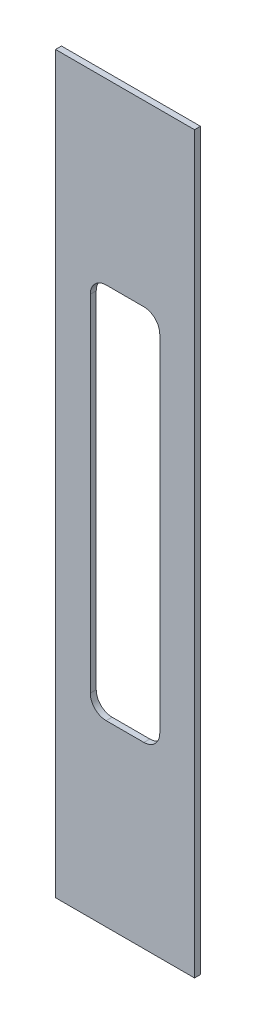
ISO-10303-21;
HEADER;
FILE_DESCRIPTION(('STEP AP214'),'2;1');
FILE_NAME('part.step','',(''),(''),'','','');
FILE_SCHEMA(('AUTOMOTIVE_DESIGN { 1 0 10303 214 1 1 1 1 }'));
ENDSEC;
DATA;
#1=APPLICATION_CONTEXT('core data for automotive mechanical design processes');
#2=APPLICATION_PROTOCOL_DEFINITION('international standard','automotive_design',2000,#1);
#3=PRODUCT_CONTEXT('',#1,'mechanical');
#4=PRODUCT('Part','Part','',(#3));
#5=PRODUCT_RELATED_PRODUCT_CATEGORY('part','',(#4));
#6=PRODUCT_DEFINITION_FORMATION('','',#4);
#7=PRODUCT_DEFINITION_CONTEXT('part definition',#1,'design');
#8=PRODUCT_DEFINITION('design','',#6,#7);
#9=PRODUCT_DEFINITION_SHAPE('','',#8);
#10=(LENGTH_UNIT() NAMED_UNIT(*) SI_UNIT(.MILLI.,.METRE.));
#11=(NAMED_UNIT(*) PLANE_ANGLE_UNIT() SI_UNIT($,.RADIAN.));
#12=(NAMED_UNIT(*) SI_UNIT($,.STERADIAN.) SOLID_ANGLE_UNIT());
#13=UNCERTAINTY_MEASURE_WITH_UNIT(LENGTH_MEASURE(1.E-05),#10,'distance_accuracy_value','');
#14=(GEOMETRIC_REPRESENTATION_CONTEXT(3) GLOBAL_UNCERTAINTY_ASSIGNED_CONTEXT((#13)) GLOBAL_UNIT_ASSIGNED_CONTEXT((#10,
#11,#12)) REPRESENTATION_CONTEXT('',''));
#15=CARTESIAN_POINT('',(0.,0.,0.));
#16=DIRECTION('',(0.,0.,1.));
#17=DIRECTION('',(1.,0.,0.));
#18=AXIS2_PLACEMENT_3D('',#15,#16,#17);
#19=CARTESIAN_POINT('',(-130.,185.,114.499999999999));
#20=DIRECTION('',(0.,1.,0.));
#21=DIRECTION('',(0.,0.,1.));
#22=AXIS2_PLACEMENT_3D('',#19,#20,#21);
#23=PLANE('',#22);
#24=DIRECTION('',(1.,0.,0.));
#25=VECTOR('',#24,1.);
#26=CARTESIAN_POINT('',(-130.,185.,111.499999999999));
#27=LINE('',#26,#25);
#28=CARTESIAN_POINT('',(-130.,185.,111.499999999999));
#29=VERTEX_POINT('',#28);
#30=CARTESIAN_POINT('',(-60.0000000000003,185.,111.499999999999));
#31=VERTEX_POINT('',#30);
#32=EDGE_CURVE('E131',#29,#31,#27,.T.);
#33=ORIENTED_EDGE('',*,*,#32,.F.);
#34=DIRECTION('',(0.,0.,-1.));
#35=VECTOR('',#34,1.);
#36=CARTESIAN_POINT('',(-130.,185.,114.499999999999));
#37=LINE('',#36,#35);
#38=CARTESIAN_POINT('',(-130.,185.,114.499999999999));
#39=VERTEX_POINT('',#38);
#40=EDGE_CURVE('E11',#39,#29,#37,.T.);
#41=ORIENTED_EDGE('',*,*,#40,.F.);
#42=DIRECTION('',(1.,0.,0.));
#43=VECTOR('',#42,1.);
#44=CARTESIAN_POINT('',(-130.,185.,114.499999999999));
#45=LINE('',#44,#43);
#46=CARTESIAN_POINT('',(-60.0000000000003,185.,114.499999999999));
#47=VERTEX_POINT('',#46);
#48=EDGE_CURVE('E181',#39,#47,#45,.T.);
#49=ORIENTED_EDGE('',*,*,#48,.T.);
#50=DIRECTION('',(0.,0.,-1.));
#51=VECTOR('',#50,1.);
#52=CARTESIAN_POINT('',(-60.0000000000003,185.,114.499999999999));
#53=LINE('',#52,#51);
#54=EDGE_CURVE('E39',#47,#31,#53,.T.);
#55=ORIENTED_EDGE('',*,*,#54,.T.);
#56=EDGE_LOOP('',(#33,#41,#49,#55));
#57=FACE_BOUND('',#56,.T.);
#58=ADVANCED_FACE('F36',(#57),#23,.T.);
#59=CARTESIAN_POINT('',(-130.,185.,114.499999999999));
#60=DIRECTION('',(-1.,0.,0.));
#61=DIRECTION('',(0.,0.,1.));
#62=AXIS2_PLACEMENT_3D('',#59,#60,#61);
#63=PLANE('',#62);
#64=DIRECTION('',(0.,1.,0.));
#65=VECTOR('',#64,1.);
#66=CARTESIAN_POINT('',(-130.,185.,111.499999999999));
#67=LINE('',#66,#65);
#68=CARTESIAN_POINT('',(-130.,-185.,111.499999999999));
#69=VERTEX_POINT('',#68);
#70=EDGE_CURVE('E185',#69,#29,#67,.T.);
#71=ORIENTED_EDGE('',*,*,#70,.F.);
#72=DIRECTION('',(0.,0.,-1.));
#73=VECTOR('',#72,1.);
#74=CARTESIAN_POINT('',(-130.,-185.,114.499999999999));
#75=LINE('',#74,#73);
#76=CARTESIAN_POINT('',(-130.,-185.,114.499999999999));
#77=VERTEX_POINT('',#76);
#78=EDGE_CURVE('E44',#77,#69,#75,.T.);
#79=ORIENTED_EDGE('',*,*,#78,.F.);
#80=DIRECTION('',(0.,1.,0.));
#81=VECTOR('',#80,1.);
#82=CARTESIAN_POINT('',(-130.,185.,114.499999999999));
#83=LINE('',#82,#81);
#84=EDGE_CURVE('E191',#77,#39,#83,.T.);
#85=ORIENTED_EDGE('',*,*,#84,.T.);
#86=ORIENTED_EDGE('',*,*,#40,.T.);
#87=EDGE_LOOP('',(#71,#79,#85,#86));
#88=FACE_BOUND('',#87,.T.);
#89=ADVANCED_FACE('F215',(#88),#63,.T.);
#90=CARTESIAN_POINT('',(-130.,-185.,114.499999999999));
#91=DIRECTION('',(0.,-1.,0.));
#92=DIRECTION('',(0.,0.,-1.));
#93=AXIS2_PLACEMENT_3D('',#90,#91,#92);
#94=PLANE('',#93);
#95=DIRECTION('',(-1.,0.,0.));
#96=VECTOR('',#95,1.);
#97=CARTESIAN_POINT('',(-130.,-185.,111.499999999999));
#98=LINE('',#97,#96);
#99=CARTESIAN_POINT('',(-60.0000000000003,-185.,111.499999999999));
#100=VERTEX_POINT('',#99);
#101=EDGE_CURVE('E199',#100,#69,#98,.T.);
#102=ORIENTED_EDGE('',*,*,#101,.F.);
#103=DIRECTION('',(0.,0.,-1.));
#104=VECTOR('',#103,1.);
#105=CARTESIAN_POINT('',(-60.0000000000003,-185.,114.499999999999));
#106=LINE('',#105,#104);
#107=CARTESIAN_POINT('',(-60.0000000000003,-185.,114.499999999999));
#108=VERTEX_POINT('',#107);
#109=EDGE_CURVE('E204',#108,#100,#106,.T.);
#110=ORIENTED_EDGE('',*,*,#109,.F.);
#111=DIRECTION('',(-1.,0.,0.));
#112=VECTOR('',#111,1.);
#113=CARTESIAN_POINT('',(-130.,-185.,114.499999999999));
#114=LINE('',#113,#112);
#115=EDGE_CURVE('E188',#108,#77,#114,.T.);
#116=ORIENTED_EDGE('',*,*,#115,.T.);
#117=ORIENTED_EDGE('',*,*,#78,.T.);
#118=EDGE_LOOP('',(#102,#110,#116,#117));
#119=FACE_BOUND('',#118,.T.);
#120=ADVANCED_FACE('F221',(#119),#94,.T.);
#121=CARTESIAN_POINT('',(-60.0000000000003,185.,114.499999999999));
#122=DIRECTION('',(1.,0.,0.));
#123=DIRECTION('',(0.,0.,-1.));
#124=AXIS2_PLACEMENT_3D('',#121,#122,#123);
#125=PLANE('',#124);
#126=DIRECTION('',(0.,-1.,0.));
#127=VECTOR('',#126,1.);
#128=CARTESIAN_POINT('',(-60.0000000000003,185.,111.499999999999));
#129=LINE('',#128,#127);
#130=EDGE_CURVE('E196',#31,#100,#129,.T.);
#131=ORIENTED_EDGE('',*,*,#130,.F.);
#132=ORIENTED_EDGE('',*,*,#54,.F.);
#133=DIRECTION('',(0.,-1.,0.));
#134=VECTOR('',#133,1.);
#135=CARTESIAN_POINT('',(-60.0000000000003,185.,114.499999999999));
#136=LINE('',#135,#134);
#137=EDGE_CURVE('E184',#47,#108,#136,.T.);
#138=ORIENTED_EDGE('',*,*,#137,.T.);
#139=ORIENTED_EDGE('',*,*,#109,.T.);
#140=EDGE_LOOP('',(#131,#132,#138,#139));
#141=FACE_BOUND('',#140,.T.);
#142=ADVANCED_FACE('F212',(#141),#125,.T.);
#143=CARTESIAN_POINT('',(-3.1780134079895E-13,0.,114.499999999999));
#144=DIRECTION('',(0.,0.,-1.));
#145=DIRECTION('',(-1.,0.,0.));
#146=AXIS2_PLACEMENT_3D('',#143,#144,#145);
#147=PLANE('',#146);
#148=DIRECTION('',(0.,-1.,0.));
#149=VECTOR('',#148,1.);
#150=CARTESIAN_POINT('',(-112.5,-87.,114.499999999999));
#151=LINE('',#150,#149);
#152=CARTESIAN_POINT('',(-112.5,86.9999999999999,114.499999999999));
#153=VERTEX_POINT('',#152);
#154=CARTESIAN_POINT('',(-112.5,-87.,114.499999999999));
#155=VERTEX_POINT('',#154);
#156=EDGE_CURVE('E145',#153,#155,#151,.T.);
#157=ORIENTED_EDGE('',*,*,#156,.F.);
#158=CARTESIAN_POINT('',(-104.5,87.,114.499999999999));
#159=DIRECTION('',(0.,0.,1.));
#160=DIRECTION('',(1.,0.,0.));
#161=AXIS2_PLACEMENT_3D('',#158,#159,#160);
#162=CIRCLE('',#161,7.99999999999999);
#163=CARTESIAN_POINT('',(-104.5,95.,114.499999999999));
#164=VERTEX_POINT('',#163);
#165=EDGE_CURVE('E52',#164,#153,#162,.T.);
#166=ORIENTED_EDGE('',*,*,#165,.F.);
#167=DIRECTION('',(-1.,0.,0.));
#168=VECTOR('',#167,1.);
#169=CARTESIAN_POINT('',(-85.5000000000003,95.,114.499999999999));
#170=LINE('',#169,#168);
#171=CARTESIAN_POINT('',(-85.5000000000003,95.,114.499999999999));
#172=VERTEX_POINT('',#171);
#173=EDGE_CURVE('E137',#172,#164,#170,.T.);
#174=ORIENTED_EDGE('',*,*,#173,.F.);
#175=CARTESIAN_POINT('',(-85.5000000000003,87.,114.499999999999));
#176=DIRECTION('',(0.,0.,1.));
#177=DIRECTION('',(1.,0.,0.));
#178=AXIS2_PLACEMENT_3D('',#175,#176,#177);
#179=CIRCLE('',#178,8.);
#180=CARTESIAN_POINT('',(-77.5000000000003,86.9999999999999,114.499999999999));
#181=VERTEX_POINT('',#180);
#182=EDGE_CURVE('E164',#181,#172,#179,.T.);
#183=ORIENTED_EDGE('',*,*,#182,.F.);
#184=DIRECTION('',(0.,1.,0.));
#185=VECTOR('',#184,1.);
#186=CARTESIAN_POINT('',(-77.5000000000003,-87.,114.499999999999));
#187=LINE('',#186,#185);
#188=CARTESIAN_POINT('',(-77.5000000000003,-87.,114.499999999999));
#189=VERTEX_POINT('',#188);
#190=EDGE_CURVE('E161',#189,#181,#187,.T.);
#191=ORIENTED_EDGE('',*,*,#190,.F.);
#192=CARTESIAN_POINT('',(-85.5000000000003,-87.,114.499999999999));
#193=DIRECTION('',(0.,0.,1.));
#194=DIRECTION('',(1.,0.,0.));
#195=AXIS2_PLACEMENT_3D('',#192,#193,#194);
#196=CIRCLE('',#195,8.00000000000001);
#197=CARTESIAN_POINT('',(-85.5000000000003,-95.,114.499999999999));
#198=VERTEX_POINT('',#197);
#199=EDGE_CURVE('E158',#198,#189,#196,.T.);
#200=ORIENTED_EDGE('',*,*,#199,.F.);
#201=DIRECTION('',(1.,0.,0.));
#202=VECTOR('',#201,1.);
#203=CARTESIAN_POINT('',(-85.5000000000003,-95.,114.499999999999));
#204=LINE('',#203,#202);
#205=CARTESIAN_POINT('',(-104.5,-95.,114.499999999999));
#206=VERTEX_POINT('',#205);
#207=EDGE_CURVE('E155',#206,#198,#204,.T.);
#208=ORIENTED_EDGE('',*,*,#207,.F.);
#209=CARTESIAN_POINT('',(-104.5,-87.,114.499999999999));
#210=DIRECTION('',(0.,0.,1.));
#211=DIRECTION('',(-1.,0.,0.));
#212=AXIS2_PLACEMENT_3D('',#209,#210,#211);
#213=CIRCLE('',#212,8.);
#214=EDGE_CURVE('E152',#155,#206,#213,.T.);
#215=ORIENTED_EDGE('',*,*,#214,.F.);
#216=EDGE_LOOP('',(#157,#166,#174,#183,#191,#200,#208,#215));
#217=FACE_BOUND('',#216,.T.);
#218=ORIENTED_EDGE('',*,*,#48,.F.);
#219=ORIENTED_EDGE('',*,*,#84,.F.);
#220=ORIENTED_EDGE('',*,*,#115,.F.);
#221=ORIENTED_EDGE('',*,*,#137,.F.);
#222=EDGE_LOOP('',(#218,#219,#220,#221));
#223=FACE_BOUND('',#222,.T.);
#224=ADVANCED_FACE('F218',(#217,#223),#147,.F.);
#225=CARTESIAN_POINT('',(-3.09474668114261E-13,0.,111.499999999999));
#226=DIRECTION('',(0.,0.,-1.));
#227=DIRECTION('',(-1.,0.,0.));
#228=AXIS2_PLACEMENT_3D('',#225,#226,#227);
#229=PLANE('',#228);
#230=CARTESIAN_POINT('',(-104.5,87.,111.499999999999));
#231=DIRECTION('',(0.,0.,-1.));
#232=DIRECTION('',(-1.,0.,0.));
#233=AXIS2_PLACEMENT_3D('',#230,#231,#232);
#234=CIRCLE('',#233,7.99999999999999);
#235=CARTESIAN_POINT('',(-104.5,95.,111.499999999999));
#236=VERTEX_POINT('',#235);
#237=CARTESIAN_POINT('',(-112.5,86.9999999999999,111.499999999999));
#238=VERTEX_POINT('',#237);
#239=EDGE_CURVE('E135',#236,#238,#234,.F.);
#240=ORIENTED_EDGE('',*,*,#239,.T.);
#241=DIRECTION('',(0.,-1.,0.));
#242=VECTOR('',#241,1.);
#243=CARTESIAN_POINT('',(-112.5,-87.,111.499999999999));
#244=LINE('',#243,#242);
#245=CARTESIAN_POINT('',(-112.5,-87.,111.499999999999));
#246=VERTEX_POINT('',#245);
#247=EDGE_CURVE('E124',#238,#246,#244,.T.);
#248=ORIENTED_EDGE('',*,*,#247,.T.);
#249=CARTESIAN_POINT('',(-104.5,-87.,111.499999999999));
#250=DIRECTION('',(0.,0.,-1.));
#251=DIRECTION('',(-1.,0.,0.));
#252=AXIS2_PLACEMENT_3D('',#249,#250,#251);
#253=CIRCLE('',#252,8.);
#254=CARTESIAN_POINT('',(-104.5,-95.,111.499999999999));
#255=VERTEX_POINT('',#254);
#256=EDGE_CURVE('E346',#246,#255,#253,.F.);
#257=ORIENTED_EDGE('',*,*,#256,.T.);
#258=DIRECTION('',(1.,0.,0.));
#259=VECTOR('',#258,1.);
#260=CARTESIAN_POINT('',(-85.5000000000003,-95.,111.499999999999));
#261=LINE('',#260,#259);
#262=CARTESIAN_POINT('',(-85.5000000000003,-95.,111.499999999999));
#263=VERTEX_POINT('',#262);
#264=EDGE_CURVE('E351',#255,#263,#261,.T.);
#265=ORIENTED_EDGE('',*,*,#264,.T.);
#266=CARTESIAN_POINT('',(-85.5000000000003,-87.,111.499999999999));
#267=DIRECTION('',(0.,0.,-1.));
#268=DIRECTION('',(-1.,0.,0.));
#269=AXIS2_PLACEMENT_3D('',#266,#267,#268);
#270=CIRCLE('',#269,8.00000000000001);
#271=CARTESIAN_POINT('',(-77.5000000000003,-87.,111.499999999999));
#272=VERTEX_POINT('',#271);
#273=EDGE_CURVE('E354',#263,#272,#270,.F.);
#274=ORIENTED_EDGE('',*,*,#273,.T.);
#275=DIRECTION('',(0.,1.,0.));
#276=VECTOR('',#275,1.);
#277=CARTESIAN_POINT('',(-77.5000000000003,-87.,111.499999999999));
#278=LINE('',#277,#276);
#279=CARTESIAN_POINT('',(-77.5000000000003,86.9999999999999,111.499999999999));
#280=VERTEX_POINT('',#279);
#281=EDGE_CURVE('E358',#272,#280,#278,.T.);
#282=ORIENTED_EDGE('',*,*,#281,.T.);
#283=CARTESIAN_POINT('',(-85.5000000000003,87.,111.499999999999));
#284=DIRECTION('',(0.,0.,-1.));
#285=DIRECTION('',(-1.,0.,0.));
#286=AXIS2_PLACEMENT_3D('',#283,#284,#285);
#287=CIRCLE('',#286,8.);
#288=CARTESIAN_POINT('',(-85.5000000000003,95.,111.499999999999));
#289=VERTEX_POINT('',#288);
#290=EDGE_CURVE('E147',#280,#289,#287,.F.);
#291=ORIENTED_EDGE('',*,*,#290,.T.);
#292=DIRECTION('',(-1.,0.,0.));
#293=VECTOR('',#292,1.);
#294=CARTESIAN_POINT('',(-85.5000000000003,95.,111.499999999999));
#295=LINE('',#294,#293);
#296=EDGE_CURVE('E143',#289,#236,#295,.T.);
#297=ORIENTED_EDGE('',*,*,#296,.T.);
#298=EDGE_LOOP('',(#240,#248,#257,#265,#274,#282,#291,#297));
#299=FACE_BOUND('',#298,.T.);
#300=ORIENTED_EDGE('',*,*,#32,.T.);
#301=ORIENTED_EDGE('',*,*,#130,.T.);
#302=ORIENTED_EDGE('',*,*,#101,.T.);
#303=ORIENTED_EDGE('',*,*,#70,.T.);
#304=EDGE_LOOP('',(#300,#301,#302,#303));
#305=FACE_BOUND('',#304,.T.);
#306=ADVANCED_FACE('F140',(#299,#305),#229,.T.);
#307=CARTESIAN_POINT('',(-104.5,87.,111.498999999999));
#308=DIRECTION('',(0.,0.,1.));
#309=DIRECTION('',(1.,0.,0.));
#310=AXIS2_PLACEMENT_3D('',#307,#308,#309);
#311=CYLINDRICAL_SURFACE('',#310,7.99999999999999);
#312=DIRECTION('',(0.,0.,1.));
#313=VECTOR('',#312,1.);
#314=CARTESIAN_POINT('',(-104.5,95.,111.498999999999));
#315=LINE('',#314,#313);
#316=EDGE_CURVE('E132',#236,#164,#315,.T.);
#317=ORIENTED_EDGE('',*,*,#316,.T.);
#318=ORIENTED_EDGE('',*,*,#165,.T.);
#319=DIRECTION('',(0.,0.,1.));
#320=VECTOR('',#319,1.);
#321=CARTESIAN_POINT('',(-112.5,86.9999999999999,111.498999999999));
#322=LINE('',#321,#320);
#323=EDGE_CURVE('E126',#238,#153,#322,.T.);
#324=ORIENTED_EDGE('',*,*,#323,.F.);
#325=ORIENTED_EDGE('',*,*,#239,.F.);
#326=EDGE_LOOP('',(#317,#318,#324,#325));
#327=FACE_BOUND('',#326,.T.);
#328=ADVANCED_FACE('F134',(#327),#311,.F.);
#329=CARTESIAN_POINT('',(-85.5000000000003,95.,111.498999999999));
#330=DIRECTION('',(0.,1.,0.));
#331=DIRECTION('',(0.,0.,1.));
#332=AXIS2_PLACEMENT_3D('',#329,#330,#331);
#333=PLANE('',#332);
#334=DIRECTION('',(0.,0.,1.));
#335=VECTOR('',#334,1.);
#336=CARTESIAN_POINT('',(-85.5000000000003,95.,111.498999999999));
#337=LINE('',#336,#335);
#338=EDGE_CURVE('E170',#289,#172,#337,.T.);
#339=ORIENTED_EDGE('',*,*,#338,.T.);
#340=ORIENTED_EDGE('',*,*,#173,.T.);
#341=ORIENTED_EDGE('',*,*,#316,.F.);
#342=ORIENTED_EDGE('',*,*,#296,.F.);
#343=EDGE_LOOP('',(#339,#340,#341,#342));
#344=FACE_BOUND('',#343,.T.);
#345=ADVANCED_FACE('F272',(#344),#333,.F.);
#346=CARTESIAN_POINT('',(-85.5000000000003,87.,111.498999999999));
#347=DIRECTION('',(0.,0.,1.));
#348=DIRECTION('',(1.,0.,0.));
#349=AXIS2_PLACEMENT_3D('',#346,#347,#348);
#350=CYLINDRICAL_SURFACE('',#349,8.);
#351=DIRECTION('',(0.,0.,1.));
#352=VECTOR('',#351,1.);
#353=CARTESIAN_POINT('',(-77.5000000000003,86.9999999999999,111.498999999999));
#354=LINE('',#353,#352);
#355=EDGE_CURVE('E172',#280,#181,#354,.T.);
#356=ORIENTED_EDGE('',*,*,#355,.T.);
#357=ORIENTED_EDGE('',*,*,#182,.T.);
#358=ORIENTED_EDGE('',*,*,#338,.F.);
#359=ORIENTED_EDGE('',*,*,#290,.F.);
#360=EDGE_LOOP('',(#356,#357,#358,#359));
#361=FACE_BOUND('',#360,.T.);
#362=ADVANCED_FACE('F281',(#361),#350,.F.);
#363=CARTESIAN_POINT('',(-77.5000000000003,-87.,111.498999999999));
#364=DIRECTION('',(1.,0.,0.));
#365=DIRECTION('',(0.,0.,-1.));
#366=AXIS2_PLACEMENT_3D('',#363,#364,#365);
#367=PLANE('',#366);
#368=DIRECTION('',(0.,0.,1.));
#369=VECTOR('',#368,1.);
#370=CARTESIAN_POINT('',(-77.5000000000003,-87.,111.498999999999));
#371=LINE('',#370,#369);
#372=EDGE_CURVE('E174',#272,#189,#371,.T.);
#373=ORIENTED_EDGE('',*,*,#372,.T.);
#374=ORIENTED_EDGE('',*,*,#190,.T.);
#375=ORIENTED_EDGE('',*,*,#355,.F.);
#376=ORIENTED_EDGE('',*,*,#281,.F.);
#377=EDGE_LOOP('',(#373,#374,#375,#376));
#378=FACE_BOUND('',#377,.T.);
#379=ADVANCED_FACE('F291',(#378),#367,.F.);
#380=CARTESIAN_POINT('',(-85.5000000000003,-87.,111.498999999999));
#381=DIRECTION('',(0.,0.,1.));
#382=DIRECTION('',(1.,0.,0.));
#383=AXIS2_PLACEMENT_3D('',#380,#381,#382);
#384=CYLINDRICAL_SURFACE('',#383,8.00000000000001);
#385=DIRECTION('',(0.,0.,1.));
#386=VECTOR('',#385,1.);
#387=CARTESIAN_POINT('',(-85.5000000000003,-95.,111.498999999999));
#388=LINE('',#387,#386);
#389=EDGE_CURVE('E176',#263,#198,#388,.T.);
#390=ORIENTED_EDGE('',*,*,#389,.T.);
#391=ORIENTED_EDGE('',*,*,#199,.T.);
#392=ORIENTED_EDGE('',*,*,#372,.F.);
#393=ORIENTED_EDGE('',*,*,#273,.F.);
#394=EDGE_LOOP('',(#390,#391,#392,#393));
#395=FACE_BOUND('',#394,.T.);
#396=ADVANCED_FACE('F301',(#395),#384,.F.);
#397=CARTESIAN_POINT('',(-85.5000000000003,-95.,111.498999999999));
#398=DIRECTION('',(0.,-1.,0.));
#399=DIRECTION('',(1.,0.,0.));
#400=AXIS2_PLACEMENT_3D('',#397,#398,#399);
#401=PLANE('',#400);
#402=DIRECTION('',(0.,0.,1.));
#403=VECTOR('',#402,1.);
#404=CARTESIAN_POINT('',(-104.5,-95.,111.498999999999));
#405=LINE('',#404,#403);
#406=EDGE_CURVE('E178',#255,#206,#405,.T.);
#407=ORIENTED_EDGE('',*,*,#406,.T.);
#408=ORIENTED_EDGE('',*,*,#207,.T.);
#409=ORIENTED_EDGE('',*,*,#389,.F.);
#410=ORIENTED_EDGE('',*,*,#264,.F.);
#411=EDGE_LOOP('',(#407,#408,#409,#410));
#412=FACE_BOUND('',#411,.T.);
#413=ADVANCED_FACE('F311',(#412),#401,.F.);
#414=CARTESIAN_POINT('',(-104.5,-87.,111.498999999999));
#415=DIRECTION('',(0.,0.,1.));
#416=DIRECTION('',(1.,0.,0.));
#417=AXIS2_PLACEMENT_3D('',#414,#415,#416);
#418=CYLINDRICAL_SURFACE('',#417,8.);
#419=DIRECTION('',(0.,0.,1.));
#420=VECTOR('',#419,1.);
#421=CARTESIAN_POINT('',(-112.5,-87.,111.498999999999));
#422=LINE('',#421,#420);
#423=EDGE_CURVE('E60',#246,#155,#422,.T.);
#424=ORIENTED_EDGE('',*,*,#423,.T.);
#425=ORIENTED_EDGE('',*,*,#214,.T.);
#426=ORIENTED_EDGE('',*,*,#406,.F.);
#427=ORIENTED_EDGE('',*,*,#256,.F.);
#428=EDGE_LOOP('',(#424,#425,#426,#427));
#429=FACE_BOUND('',#428,.T.);
#430=ADVANCED_FACE('F321',(#429),#418,.F.);
#431=CARTESIAN_POINT('',(-112.5,-87.,111.498999999999));
#432=DIRECTION('',(-1.,0.,0.));
#433=DIRECTION('',(0.,0.,1.));
#434=AXIS2_PLACEMENT_3D('',#431,#432,#433);
#435=PLANE('',#434);
#436=ORIENTED_EDGE('',*,*,#323,.T.);
#437=ORIENTED_EDGE('',*,*,#156,.T.);
#438=ORIENTED_EDGE('',*,*,#423,.F.);
#439=ORIENTED_EDGE('',*,*,#247,.F.);
#440=EDGE_LOOP('',(#436,#437,#438,#439));
#441=FACE_BOUND('',#440,.T.);
#442=ADVANCED_FACE('F125',(#441),#435,.F.);
#443=CLOSED_SHELL('',(#58,#89,#120,#142,#224,#306,#328,#345,#362,#379,#396,#413,#430,#442));
#444=MANIFOLD_SOLID_BREP('B2',#443);
#445=ADVANCED_BREP_SHAPE_REPRESENTATION('',(#18,#444),#14);
#446=SHAPE_DEFINITION_REPRESENTATION(#9,#445);
ENDSEC;
END-ISO-10303-21;
